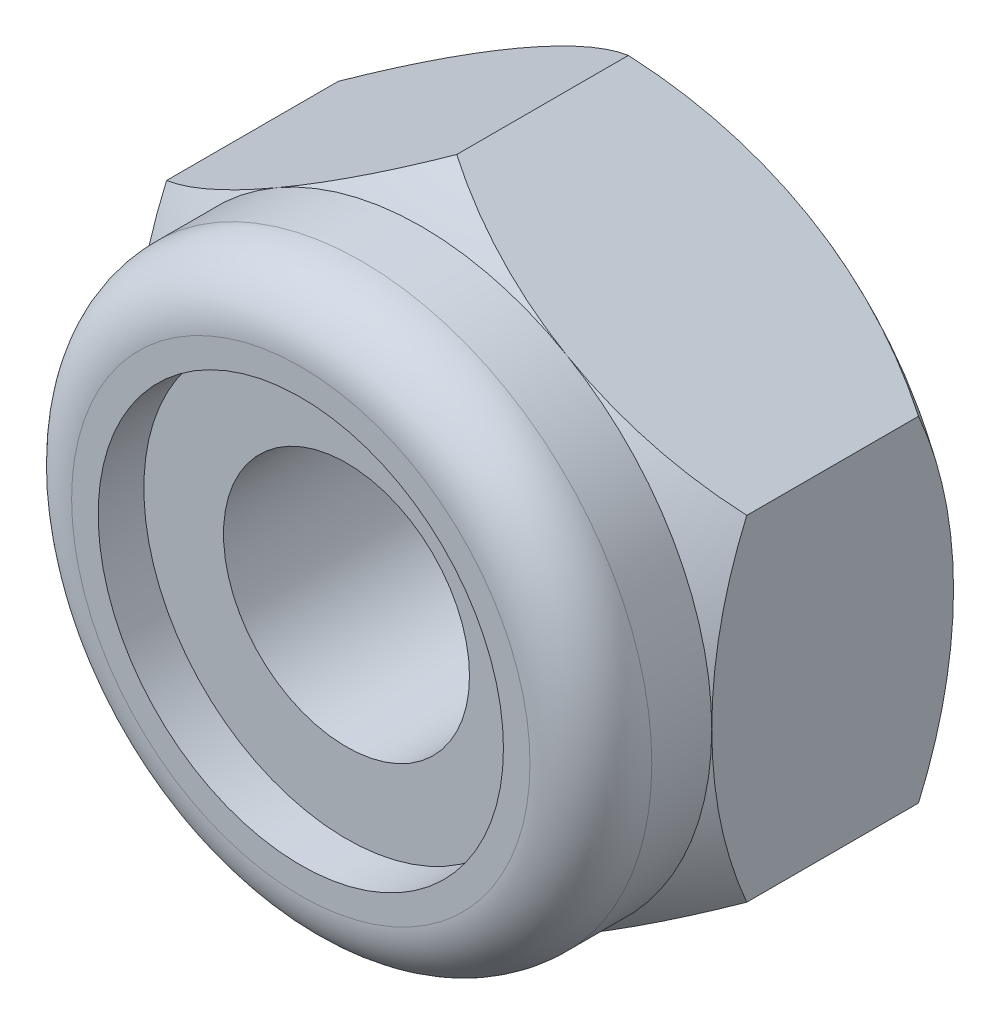
ISO-10303-21;
HEADER;
FILE_DESCRIPTION(('STEP AP214'),'2;1');
FILE_NAME('part.step','',(''),(''),'','','');
FILE_SCHEMA(('AUTOMOTIVE_DESIGN { 1 0 10303 214 1 1 1 1 }'));
ENDSEC;
DATA;
#1=APPLICATION_CONTEXT('core data for automotive mechanical design processes');
#2=APPLICATION_PROTOCOL_DEFINITION('international standard','automotive_design',2000,#1);
#3=PRODUCT_CONTEXT('',#1,'mechanical');
#4=PRODUCT('Part','Part','',(#3));
#5=PRODUCT_RELATED_PRODUCT_CATEGORY('part','',(#4));
#6=PRODUCT_DEFINITION_FORMATION('','',#4);
#7=PRODUCT_DEFINITION_CONTEXT('part definition',#1,'design');
#8=PRODUCT_DEFINITION('design','',#6,#7);
#9=PRODUCT_DEFINITION_SHAPE('','',#8);
#10=(LENGTH_UNIT() NAMED_UNIT(*) SI_UNIT(.MILLI.,.METRE.));
#11=(NAMED_UNIT(*) PLANE_ANGLE_UNIT() SI_UNIT($,.RADIAN.));
#12=(NAMED_UNIT(*) SI_UNIT($,.STERADIAN.) SOLID_ANGLE_UNIT());
#13=UNCERTAINTY_MEASURE_WITH_UNIT(LENGTH_MEASURE(1.E-05),#10,'distance_accuracy_value','');
#14=(GEOMETRIC_REPRESENTATION_CONTEXT(3) GLOBAL_UNCERTAINTY_ASSIGNED_CONTEXT((#13)) GLOBAL_UNIT_ASSIGNED_CONTEXT((#10,
#11,#12)) REPRESENTATION_CONTEXT('',''));
#15=CARTESIAN_POINT('',(0.,0.,0.));
#16=DIRECTION('',(0.,0.,1.));
#17=DIRECTION('',(1.,0.,0.));
#18=AXIS2_PLACEMENT_3D('',#15,#16,#17);
#19=CARTESIAN_POINT('',(0.,0.,4.953125));
#20=DIRECTION('',(0.,0.,1.));
#21=DIRECTION('',(1.,0.,0.));
#22=AXIS2_PLACEMENT_3D('',#19,#20,#21);
#23=TOROIDAL_SURFACE('',#22,3.7625,1.);
#24=CARTESIAN_POINT('',(0.,0.,4.953125));
#25=DIRECTION('',(0.,0.,-1.));
#26=DIRECTION('',(-1.,0.,0.));
#27=AXIS2_PLACEMENT_3D('',#24,#25,#26);
#28=CIRCLE('',#27,4.7625);
#29=CARTESIAN_POINT('',(-4.7625,0.,4.953125));
#30=VERTEX_POINT('',#29);
#31=EDGE_CURVE('E123',#30,#30,#28,.T.);
#32=ORIENTED_EDGE('',*,*,#31,.F.);
#33=EDGE_LOOP('',(#32));
#34=FACE_BOUND('',#33,.T.);
#35=CARTESIAN_POINT('',(0.,0.,5.953125));
#36=DIRECTION('',(0.,0.,-1.));
#37=DIRECTION('',(1.,0.,0.));
#38=AXIS2_PLACEMENT_3D('',#35,#36,#37);
#39=CIRCLE('',#38,3.7625);
#40=CARTESIAN_POINT('',(-3.7625,0.,5.953125));
#41=VERTEX_POINT('',#40);
#42=CARTESIAN_POINT('',(3.7625,0.,5.953125));
#43=VERTEX_POINT('',#42);
#44=EDGE_CURVE('E113',#41,#43,#39,.F.);
#45=ORIENTED_EDGE('',*,*,#44,.F.);
#46=CARTESIAN_POINT('',(0.,0.,5.953125));
#47=DIRECTION('',(0.,0.,-1.));
#48=DIRECTION('',(-1.,0.,0.));
#49=AXIS2_PLACEMENT_3D('',#46,#47,#48);
#50=CIRCLE('',#49,3.7625);
#51=EDGE_CURVE('E117',#43,#41,#50,.F.);
#52=ORIENTED_EDGE('',*,*,#51,.F.);
#53=EDGE_LOOP('',(#45,#52));
#54=FACE_BOUND('',#53,.T.);
#55=ADVANCED_FACE('F15',(#34,#54),#23,.T.);
#56=CARTESIAN_POINT('',(0.,0.,5.953125));
#57=DIRECTION('',(0.,0.,1.));
#58=DIRECTION('',(1.,0.,0.));
#59=AXIS2_PLACEMENT_3D('',#56,#57,#58);
#60=PLANE('',#59);
#61=CARTESIAN_POINT('',(0.,0.,5.953125));
#62=DIRECTION('',(0.,0.,1.));
#63=DIRECTION('',(1.,0.,0.));
#64=AXIS2_PLACEMENT_3D('',#61,#62,#63);
#65=CIRCLE('',#64,3.32676299779793);
#66=CARTESIAN_POINT('',(3.32676299779793,0.,5.953125));
#67=VERTEX_POINT('',#66);
#68=EDGE_CURVE('E269',#67,#67,#65,.F.);
#69=ORIENTED_EDGE('',*,*,#68,.T.);
#70=EDGE_LOOP('',(#69));
#71=FACE_BOUND('',#70,.T.);
#72=ORIENTED_EDGE('',*,*,#51,.T.);
#73=ORIENTED_EDGE('',*,*,#44,.T.);
#74=EDGE_LOOP('',(#72,#73));
#75=FACE_BOUND('',#74,.T.);
#76=ADVANCED_FACE('F122',(#71,#75),#60,.T.);
#77=CARTESIAN_POINT('',(0.,0.,5.953125));
#78=DIRECTION('',(0.,0.,-1.));
#79=DIRECTION('',(-1.,0.,0.));
#80=AXIS2_PLACEMENT_3D('',#77,#78,#79);
#81=CYLINDRICAL_SURFACE('',#80,4.7625);
#82=ORIENTED_EDGE('',*,*,#31,.T.);
#83=EDGE_LOOP('',(#82));
#84=FACE_BOUND('',#83,.T.);
#85=CARTESIAN_POINT('',(0.,0.,3.96875000000001));
#86=DIRECTION('',(0.,0.,-1.));
#87=DIRECTION('',(-1.,0.,0.));
#88=AXIS2_PLACEMENT_3D('',#85,#86,#87);
#89=CIRCLE('',#88,4.7625);
#90=CARTESIAN_POINT('',(2.38124999999999,-4.1244459855234,3.96875000000001));
#91=VERTEX_POINT('',#90);
#92=CARTESIAN_POINT('',(-2.38124999999999,-4.1244459855234,3.96875000000002));
#93=VERTEX_POINT('',#92);
#94=EDGE_CURVE('E106',#91,#93,#89,.T.);
#95=ORIENTED_EDGE('',*,*,#94,.F.);
#96=CARTESIAN_POINT('',(0.,0.,3.96875000000001));
#97=DIRECTION('',(0.,0.,-1.));
#98=DIRECTION('',(-1.,0.,0.));
#99=AXIS2_PLACEMENT_3D('',#96,#97,#98);
#100=CIRCLE('',#99,4.7625);
#101=CARTESIAN_POINT('',(4.76249999999073,0.,3.96875000000644));
#102=VERTEX_POINT('',#101);
#103=EDGE_CURVE('E255',#102,#91,#100,.T.);
#104=ORIENTED_EDGE('',*,*,#103,.F.);
#105=CARTESIAN_POINT('',(0.,0.,3.96875000000001));
#106=DIRECTION('',(0.,0.,-1.));
#107=DIRECTION('',(-1.,0.,0.));
#108=AXIS2_PLACEMENT_3D('',#105,#106,#107);
#109=CIRCLE('',#108,4.7625);
#110=CARTESIAN_POINT('',(2.38125,4.12444598552339,3.96875000000001));
#111=VERTEX_POINT('',#110);
#112=EDGE_CURVE('E257',#111,#102,#109,.T.);
#113=ORIENTED_EDGE('',*,*,#112,.F.);
#114=CARTESIAN_POINT('',(0.,0.,3.96875000000001));
#115=DIRECTION('',(0.,0.,-1.));
#116=DIRECTION('',(-1.,0.,0.));
#117=AXIS2_PLACEMENT_3D('',#114,#115,#116);
#118=CIRCLE('',#117,4.7625);
#119=CARTESIAN_POINT('',(-2.38125,4.12444598552339,3.96875000000001));
#120=VERTEX_POINT('',#119);
#121=EDGE_CURVE('E260',#120,#111,#118,.T.);
#122=ORIENTED_EDGE('',*,*,#121,.F.);
#123=CARTESIAN_POINT('',(0.,0.,3.96875000000001));
#124=DIRECTION('',(0.,0.,-1.));
#125=DIRECTION('',(-1.,0.,0.));
#126=AXIS2_PLACEMENT_3D('',#123,#124,#125);
#127=CIRCLE('',#126,4.7625);
#128=CARTESIAN_POINT('',(-4.76249999999074,0.,3.96875000000645));
#129=VERTEX_POINT('',#128);
#130=EDGE_CURVE('E263',#129,#120,#127,.T.);
#131=ORIENTED_EDGE('',*,*,#130,.F.);
#132=CARTESIAN_POINT('',(0.,0.,3.96875000000001));
#133=DIRECTION('',(0.,0.,-1.));
#134=DIRECTION('',(-1.,0.,0.));
#135=AXIS2_PLACEMENT_3D('',#132,#133,#134);
#136=CIRCLE('',#135,4.7625);
#137=EDGE_CURVE('E266',#93,#129,#136,.T.);
#138=ORIENTED_EDGE('',*,*,#137,.F.);
#139=EDGE_LOOP('',(#95,#104,#113,#122,#131,#138));
#140=FACE_BOUND('',#139,.T.);
#141=ADVANCED_FACE('F141',(#84,#140),#81,.T.);
#142=CARTESIAN_POINT('',(0.,0.,5.953125));
#143=DIRECTION('',(0.,0.,1.));
#144=DIRECTION('',(1.,0.,0.));
#145=AXIS2_PLACEMENT_3D('',#142,#143,#144);
#146=CYLINDRICAL_SURFACE('',#145,3.32676299779793);
#147=CARTESIAN_POINT('',(0.,0.,5.203125));
#148=DIRECTION('',(0.,0.,1.));
#149=DIRECTION('',(1.,0.,0.));
#150=AXIS2_PLACEMENT_3D('',#147,#148,#149);
#151=CIRCLE('',#150,3.32676299779793);
#152=CARTESIAN_POINT('',(3.32676299779793,0.,5.203125));
#153=VERTEX_POINT('',#152);
#154=EDGE_CURVE('E252',#153,#153,#151,.F.);
#155=ORIENTED_EDGE('',*,*,#154,.T.);
#156=EDGE_LOOP('',(#155));
#157=FACE_BOUND('',#156,.T.);
#158=ORIENTED_EDGE('',*,*,#68,.F.);
#159=EDGE_LOOP('',(#158));
#160=FACE_BOUND('',#159,.T.);
#161=ADVANCED_FACE('F276',(#157,#160),#146,.F.);
#162=CARTESIAN_POINT('',(0.,0.,-2.89662617308758));
#163=DIRECTION('',(1.,0.,0.));
#164=DIRECTION('',(0.,-0.514062280042823,0.857752861981337));
#165=AXIS2_PLACEMENT_3D('',#162,#163,#164);
#166=SPHERICAL_SURFACE('',#165,8.3555248936257);
#167=CARTESIAN_POINT('',(2.38125,-4.1244459855234,-2.89662617308758));
#168=DIRECTION('',(0.5,-0.866025403784439,0.));
#169=DIRECTION('',(0.866025403784439,0.5,0.));
#170=AXIS2_PLACEMENT_3D('',#167,#168,#169);
#171=CIRCLE('',#170,6.86537617308759);
#172=CARTESIAN_POINT('',(3.73982528972805E-11,-5.49926131405278,3.39407499989476));
#173=VERTEX_POINT('',#172);
#174=EDGE_CURVE('E247',#91,#173,#171,.T.);
#175=ORIENTED_EDGE('',*,*,#174,.F.);
#176=ORIENTED_EDGE('',*,*,#94,.T.);
#177=CARTESIAN_POINT('',(-2.38125,-4.1244459855234,-2.89662617308758));
#178=DIRECTION('',(-0.5,-0.866025403784439,0.));
#179=DIRECTION('',(0.866025403784439,-0.5,0.));
#180=AXIS2_PLACEMENT_3D('',#177,#178,#179);
#181=CIRCLE('',#180,6.86537617308759);
#182=EDGE_CURVE('E243',#173,#93,#181,.T.);
#183=ORIENTED_EDGE('',*,*,#182,.F.);
#184=EDGE_LOOP('',(#175,#176,#183));
#185=FACE_BOUND('',#184,.T.);
#186=ADVANCED_FACE('F149',(#185),#166,.T.);
#187=CARTESIAN_POINT('',(0.,0.,-2.89662617308762));
#188=DIRECTION('',(1.,0.,0.));
#189=DIRECTION('',(0.,0.00324586478599376,0.999994732167021));
#190=AXIS2_PLACEMENT_3D('',#187,#188,#189);
#191=SPHERICAL_SURFACE('',#190,8.35552489362575);
#192=CARTESIAN_POINT('',(-2.38124999999997,-4.12444598552341,-2.89662617308762));
#193=DIRECTION('',(-0.5,-0.866025403784439,0.));
#194=DIRECTION('',(0.866025403784439,-0.5,0.));
#195=AXIS2_PLACEMENT_3D('',#192,#193,#194);
#196=CIRCLE('',#195,6.86537617308764);
#197=CARTESIAN_POINT('',(-4.7625,-2.74963065700324,3.39407499991903));
#198=VERTEX_POINT('',#197);
#199=EDGE_CURVE('E241',#93,#198,#196,.T.);
#200=ORIENTED_EDGE('',*,*,#199,.F.);
#201=ORIENTED_EDGE('',*,*,#137,.T.);
#202=CARTESIAN_POINT('',(-4.7625,0.,-2.89662617308762));
#203=DIRECTION('',(1.,0.,0.));
#204=DIRECTION('',(0.,0.,-1.));
#205=AXIS2_PLACEMENT_3D('',#202,#203,#204);
#206=CIRCLE('',#205,6.86537617308763);
#207=EDGE_CURVE('E237',#198,#129,#206,.F.);
#208=ORIENTED_EDGE('',*,*,#207,.F.);
#209=EDGE_LOOP('',(#200,#201,#208));
#210=FACE_BOUND('',#209,.T.);
#211=ADVANCED_FACE('F389',(#210),#191,.T.);
#212=CARTESIAN_POINT('',(0.,0.,-2.89662617308757));
#213=DIRECTION('',(1.,0.,0.));
#214=DIRECTION('',(0.,0.517754599312686,0.855529178281232));
#215=AXIS2_PLACEMENT_3D('',#212,#213,#214);
#216=SPHERICAL_SURFACE('',#215,8.35552489362573);
#217=CARTESIAN_POINT('',(-4.76249999998147,0.,-2.89662617308757));
#218=DIRECTION('',(1.,0.,0.));
#219=DIRECTION('',(0.,0.,-1.));
#220=AXIS2_PLACEMENT_3D('',#217,#218,#219);
#221=CIRCLE('',#220,6.86537617310046);
#222=CARTESIAN_POINT('',(-4.76249999994795,2.74963065704565,3.39407499993991));
#223=VERTEX_POINT('',#222);
#224=EDGE_CURVE('E235',#129,#223,#221,.F.);
#225=ORIENTED_EDGE('',*,*,#224,.F.);
#226=ORIENTED_EDGE('',*,*,#130,.T.);
#227=CARTESIAN_POINT('',(-2.38125000000001,4.12444598552338,-2.89662617308757));
#228=DIRECTION('',(-0.5,0.866025403784439,0.));
#229=DIRECTION('',(-0.866025403784439,-0.5,0.));
#230=AXIS2_PLACEMENT_3D('',#227,#228,#229);
#231=CIRCLE('',#230,6.86537617308758);
#232=EDGE_CURVE('E231',#223,#120,#231,.T.);
#233=ORIENTED_EDGE('',*,*,#232,.F.);
#234=EDGE_LOOP('',(#225,#226,#233));
#235=FACE_BOUND('',#234,.T.);
#236=ADVANCED_FACE('F401',(#235),#216,.T.);
#237=CARTESIAN_POINT('',(0.,0.,-2.89662617308755));
#238=DIRECTION('',(1.,0.,0.));
#239=DIRECTION('',(0.,0.658959645209422,0.752178294013775));
#240=AXIS2_PLACEMENT_3D('',#237,#238,#239);
#241=SPHERICAL_SURFACE('',#240,8.35552489362568);
#242=ORIENTED_EDGE('',*,*,#121,.T.);
#243=CARTESIAN_POINT('',(2.38125,4.12444598552339,-2.89662617308755));
#244=DIRECTION('',(0.5,0.866025403784439,0.));
#245=DIRECTION('',(-0.866025403784439,0.5,0.));
#246=AXIS2_PLACEMENT_3D('',#243,#244,#245);
#247=CIRCLE('',#246,6.86537617308756);
#248=CARTESIAN_POINT('',(4.83337328494038E-11,5.49926131400328,3.39407499993803));
#249=VERTEX_POINT('',#248);
#250=EDGE_CURVE('E225',#249,#111,#247,.T.);
#251=ORIENTED_EDGE('',*,*,#250,.F.);
#252=CARTESIAN_POINT('',(-2.38125,4.12444598552339,-2.89662617308755));
#253=DIRECTION('',(-0.5,0.866025403784439,0.));
#254=DIRECTION('',(-0.866025403784439,-0.5,0.));
#255=AXIS2_PLACEMENT_3D('',#252,#253,#254);
#256=CIRCLE('',#255,6.86537617308756);
#257=EDGE_CURVE('E229',#120,#249,#256,.T.);
#258=ORIENTED_EDGE('',*,*,#257,.F.);
#259=EDGE_LOOP('',(#242,#251,#258));
#260=FACE_BOUND('',#259,.T.);
#261=ADVANCED_FACE('F339',(#260),#241,.T.);
#262=CARTESIAN_POINT('',(0.,0.,-2.89662617308756));
#263=DIRECTION('',(1.,0.,0.));
#264=DIRECTION('',(0.,0.517754599312686,0.855529178281232));
#265=AXIS2_PLACEMENT_3D('',#262,#263,#264);
#266=SPHERICAL_SURFACE('',#265,8.35552489362571);
#267=ORIENTED_EDGE('',*,*,#112,.T.);
#268=CARTESIAN_POINT('',(4.76250000000002,0.,-2.89662617308756));
#269=DIRECTION('',(1.,0.,0.));
#270=DIRECTION('',(0.,0.,-1.));
#271=AXIS2_PLACEMENT_3D('',#268,#269,#270);
#272=CIRCLE('',#271,6.86537617308759);
#273=CARTESIAN_POINT('',(4.76250000000002,2.74963065695978,3.39407499993802));
#274=VERTEX_POINT('',#273);
#275=EDGE_CURVE('E219',#274,#102,#272,.T.);
#276=ORIENTED_EDGE('',*,*,#275,.F.);
#277=CARTESIAN_POINT('',(2.38125000000001,4.12444598552338,-2.89662617308756));
#278=DIRECTION('',(0.5,0.866025403784439,0.));
#279=DIRECTION('',(-0.866025403784439,0.5,0.));
#280=AXIS2_PLACEMENT_3D('',#277,#278,#279);
#281=CIRCLE('',#280,6.86537617308757);
#282=EDGE_CURVE('E223',#111,#274,#281,.T.);
#283=ORIENTED_EDGE('',*,*,#282,.F.);
#284=EDGE_LOOP('',(#267,#276,#283));
#285=FACE_BOUND('',#284,.T.);
#286=ADVANCED_FACE('F328',(#285),#266,.T.);
#287=CARTESIAN_POINT('',(0.,0.,-2.8966261730876));
#288=DIRECTION('',(1.,0.,0.));
#289=DIRECTION('',(0.,0.00324586478599376,0.999994732167021));
#290=AXIS2_PLACEMENT_3D('',#287,#288,#289);
#291=SPHERICAL_SURFACE('',#290,8.35552489362573);
#292=ORIENTED_EDGE('',*,*,#103,.T.);
#293=CARTESIAN_POINT('',(2.38124999999998,-4.1244459855234,-2.8966261730876));
#294=DIRECTION('',(0.5,-0.866025403784439,0.));
#295=DIRECTION('',(0.866025403784439,0.5,0.));
#296=AXIS2_PLACEMENT_3D('',#293,#294,#295);
#297=CIRCLE('',#296,6.86537617308761);
#298=CARTESIAN_POINT('',(4.76249999998147,-2.74963065704565,3.39407499991452));
#299=VERTEX_POINT('',#298);
#300=EDGE_CURVE('E249',#299,#91,#297,.T.);
#301=ORIENTED_EDGE('',*,*,#300,.F.);
#302=CARTESIAN_POINT('',(4.76249999998147,0.,-2.8966261730876));
#303=DIRECTION('',(1.,0.,0.));
#304=DIRECTION('',(0.,0.,-1.));
#305=AXIS2_PLACEMENT_3D('',#302,#303,#304);
#306=CIRCLE('',#305,6.86537617310046);
#307=EDGE_CURVE('E216',#102,#299,#306,.T.);
#308=ORIENTED_EDGE('',*,*,#307,.F.);
#309=EDGE_LOOP('',(#292,#301,#308));
#310=FACE_BOUND('',#309,.T.);
#311=ADVANCED_FACE('F323',(#310),#291,.T.);
#312=CARTESIAN_POINT('',(2.01930000000001,0.,5.203125));
#313=DIRECTION('',(0.,0.,-1.));
#314=DIRECTION('',(-1.,0.,0.));
#315=AXIS2_PLACEMENT_3D('',#312,#313,#314);
#316=PLANE('',#315);
#317=ORIENTED_EDGE('',*,*,#154,.F.);
#318=EDGE_LOOP('',(#317));
#319=FACE_BOUND('',#318,.T.);
#320=CARTESIAN_POINT('',(0.,0.,5.203125));
#321=DIRECTION('',(0.,0.,1.));
#322=DIRECTION('',(1.,0.,0.));
#323=AXIS2_PLACEMENT_3D('',#320,#321,#322);
#324=CIRCLE('',#323,2.01930000000001);
#325=CARTESIAN_POINT('',(2.01930000000001,0.,5.203125));
#326=VERTEX_POINT('',#325);
#327=EDGE_CURVE('E212',#326,#326,#324,.F.);
#328=ORIENTED_EDGE('',*,*,#327,.T.);
#329=EDGE_LOOP('',(#328));
#330=FACE_BOUND('',#329,.T.);
#331=ADVANCED_FACE('F320',(#319,#330),#316,.F.);
#332=CARTESIAN_POINT('',(2.38125,-4.12444598552339,1.984375));
#333=DIRECTION('',(0.5,-0.866025403784439,0.));
#334=DIRECTION('',(0.866025403784439,0.5,0.));
#335=AXIS2_PLACEMENT_3D('',#332,#333,#334);
#336=PLANE('',#335);
#337=CARTESIAN_POINT('',(2.38125,-4.12444598552339,6.86537617308756));
#338=DIRECTION('',(0.5,-0.866025403784439,0.));
#339=DIRECTION('',(0.866025403784439,0.5,0.));
#340=AXIS2_PLACEMENT_3D('',#337,#338,#339);
#341=CIRCLE('',#340,6.86537617308756);
#342=CARTESIAN_POINT('',(2.38125,-4.12444598552339,0.));
#343=VERTEX_POINT('',#342);
#344=CARTESIAN_POINT('',(3.73983613174977E-11,-5.49926131405278,0.574675000105255));
#345=VERTEX_POINT('',#344);
#346=EDGE_CURVE('E203',#343,#345,#341,.F.);
#347=ORIENTED_EDGE('',*,*,#346,.F.);
#348=CARTESIAN_POINT('',(2.38124999999999,-4.1244459855234,6.86537617308758));
#349=DIRECTION('',(0.5,-0.866025403784439,0.));
#350=DIRECTION('',(0.866025403784439,0.5,0.));
#351=AXIS2_PLACEMENT_3D('',#348,#349,#350);
#352=CIRCLE('',#351,6.86537617308757);
#353=CARTESIAN_POINT('',(4.7625,-2.7496306570403,0.574675000097181));
#354=VERTEX_POINT('',#353);
#355=EDGE_CURVE('E206',#354,#343,#352,.F.);
#356=ORIENTED_EDGE('',*,*,#355,.F.);
#357=DIRECTION('',(0.,0.,-1.));
#358=VECTOR('',#357,1.);
#359=CARTESIAN_POINT('',(4.7625,-2.749630657065,1.984375));
#360=LINE('',#359,#358);
#361=EDGE_CURVE('E215',#299,#354,#360,.T.);
#362=ORIENTED_EDGE('',*,*,#361,.F.);
#363=ORIENTED_EDGE('',*,*,#300,.T.);
#364=ORIENTED_EDGE('',*,*,#174,.T.);
#365=DIRECTION('',(0.,0.,1.));
#366=VECTOR('',#365,1.);
#367=CARTESIAN_POINT('',(7.4795638432823E-11,-5.49926131407437,1.984375));
#368=LINE('',#367,#366);
#369=EDGE_CURVE('E246',#345,#173,#368,.T.);
#370=ORIENTED_EDGE('',*,*,#369,.F.);
#371=EDGE_LOOP('',(#347,#356,#362,#363,#364,#370));
#372=FACE_BOUND('',#371,.T.);
#373=ADVANCED_FACE('F316',(#372),#336,.T.);
#374=CARTESIAN_POINT('',(-2.38125,-4.12444598552339,1.984375));
#375=DIRECTION('',(-0.5,-0.866025403784439,0.));
#376=DIRECTION('',(0.866025403784439,-0.5,0.));
#377=AXIS2_PLACEMENT_3D('',#374,#375,#376);
#378=PLANE('',#377);
#379=CARTESIAN_POINT('',(-2.38124999999997,-4.12444598552341,6.86537617308761));
#380=DIRECTION('',(-0.5,-0.866025403784439,0.));
#381=DIRECTION('',(0.866025403784439,-0.5,0.));
#382=AXIS2_PLACEMENT_3D('',#379,#380,#381);
#383=CIRCLE('',#382,6.86537617308761);
#384=CARTESIAN_POINT('',(-2.38124999999999,-4.1244459855234,0.));
#385=VERTEX_POINT('',#384);
#386=CARTESIAN_POINT('',(-4.7624999999984,-2.74963065700015,0.574675000078425));
#387=VERTEX_POINT('',#386);
#388=EDGE_CURVE('E194',#385,#387,#383,.F.);
#389=ORIENTED_EDGE('',*,*,#388,.F.);
#390=CARTESIAN_POINT('',(-2.38125,-4.12444598552339,6.86537617308756));
#391=DIRECTION('',(-0.5,-0.866025403784439,0.));
#392=DIRECTION('',(0.866025403784439,-0.5,0.));
#393=AXIS2_PLACEMENT_3D('',#390,#391,#392);
#394=CIRCLE('',#393,6.86537617308756);
#395=EDGE_CURVE('E200',#345,#385,#394,.F.);
#396=ORIENTED_EDGE('',*,*,#395,.F.);
#397=ORIENTED_EDGE('',*,*,#369,.T.);
#398=ORIENTED_EDGE('',*,*,#182,.T.);
#399=ORIENTED_EDGE('',*,*,#199,.T.);
#400=DIRECTION('',(0.,0.,1.));
#401=VECTOR('',#400,1.);
#402=CARTESIAN_POINT('',(-4.7625,-2.74963065699089,1.984375));
#403=LINE('',#402,#401);
#404=EDGE_CURVE('E240',#387,#198,#403,.T.);
#405=ORIENTED_EDGE('',*,*,#404,.F.);
#406=EDGE_LOOP('',(#389,#396,#397,#398,#399,#405));
#407=FACE_BOUND('',#406,.T.);
#408=ADVANCED_FACE('F312',(#407),#378,.T.);
#409=CARTESIAN_POINT('',(-4.7625,0.,1.984375));
#410=DIRECTION('',(-1.,0.,0.));
#411=DIRECTION('',(0.,0.,1.));
#412=AXIS2_PLACEMENT_3D('',#409,#410,#411);
#413=PLANE('',#412);
#414=CARTESIAN_POINT('',(-4.76249999999999,0.,6.86537617308759));
#415=DIRECTION('',(1.,0.,0.));
#416=DIRECTION('',(0.,0.,-1.));
#417=AXIS2_PLACEMENT_3D('',#414,#415,#416);
#418=CIRCLE('',#417,6.86537617308759);
#419=CARTESIAN_POINT('',(-4.76249999999652,0.,-2.40649514204883E-12));
#420=VERTEX_POINT('',#419);
#421=CARTESIAN_POINT('',(-4.76249999995722,2.7496306570403,0.574675000064785));
#422=VERTEX_POINT('',#421);
#423=EDGE_CURVE('E191',#420,#422,#418,.T.);
#424=ORIENTED_EDGE('',*,*,#423,.F.);
#425=CARTESIAN_POINT('',(-4.7624999999861,0.,6.8653761730876));
#426=DIRECTION('',(1.,0.,0.));
#427=DIRECTION('',(0.,0.,-1.));
#428=AXIS2_PLACEMENT_3D('',#425,#426,#427);
#429=CIRCLE('',#428,6.86537617309723);
#430=EDGE_CURVE('E197',#387,#420,#429,.T.);
#431=ORIENTED_EDGE('',*,*,#430,.F.);
#432=ORIENTED_EDGE('',*,*,#404,.T.);
#433=ORIENTED_EDGE('',*,*,#207,.T.);
#434=ORIENTED_EDGE('',*,*,#224,.T.);
#435=DIRECTION('',(0.,0.,1.));
#436=VECTOR('',#435,1.);
#437=CARTESIAN_POINT('',(-4.76249999991443,2.749630657065,1.984375));
#438=LINE('',#437,#436);
#439=EDGE_CURVE('E234',#422,#223,#438,.T.);
#440=ORIENTED_EDGE('',*,*,#439,.F.);
#441=EDGE_LOOP('',(#424,#431,#432,#433,#434,#440));
#442=FACE_BOUND('',#441,.T.);
#443=ADVANCED_FACE('F308',(#442),#413,.T.);
#444=CARTESIAN_POINT('',(-2.38125,4.12444598552339,1.984375));
#445=DIRECTION('',(-0.5,0.866025403784439,0.));
#446=DIRECTION('',(-0.866025403784439,-0.5,0.));
#447=AXIS2_PLACEMENT_3D('',#444,#445,#446);
#448=PLANE('',#447);
#449=CARTESIAN_POINT('',(-2.38125,4.12444598552339,6.86537617308756));
#450=DIRECTION('',(-0.5,0.866025403784439,0.));
#451=DIRECTION('',(-0.866025403784439,-0.5,0.));
#452=AXIS2_PLACEMENT_3D('',#449,#450,#451);
#453=CIRCLE('',#452,6.86537617308756);
#454=CARTESIAN_POINT('',(-2.38125,4.12444598552339,0.));
#455=VERTEX_POINT('',#454);
#456=CARTESIAN_POINT('',(4.83337328494038E-11,5.49926131400328,0.574675000061984));
#457=VERTEX_POINT('',#456);
#458=EDGE_CURVE('E185',#455,#457,#453,.F.);
#459=ORIENTED_EDGE('',*,*,#458,.F.);
#460=CARTESIAN_POINT('',(-2.38124999999999,4.1244459855234,6.86537617308758));
#461=DIRECTION('',(-0.5,0.866025403784439,0.));
#462=DIRECTION('',(-0.866025403784439,-0.5,0.));
#463=AXIS2_PLACEMENT_3D('',#460,#461,#462);
#464=CIRCLE('',#463,6.86537617308759);
#465=EDGE_CURVE('E188',#422,#455,#464,.F.);
#466=ORIENTED_EDGE('',*,*,#465,.F.);
#467=ORIENTED_EDGE('',*,*,#439,.T.);
#468=ORIENTED_EDGE('',*,*,#232,.T.);
#469=ORIENTED_EDGE('',*,*,#257,.T.);
#470=DIRECTION('',(0.,0.,1.));
#471=VECTOR('',#470,1.);
#472=CARTESIAN_POINT('',(9.66687667414146E-11,5.49926131397537,1.984375));
#473=LINE('',#472,#471);
#474=EDGE_CURVE('E228',#457,#249,#473,.T.);
#475=ORIENTED_EDGE('',*,*,#474,.F.);
#476=EDGE_LOOP('',(#459,#466,#467,#468,#469,#475));
#477=FACE_BOUND('',#476,.T.);
#478=ADVANCED_FACE('F305',(#477),#448,.T.);
#479=CARTESIAN_POINT('',(2.38125,4.12444598552339,1.984375));
#480=DIRECTION('',(0.5,0.866025403784439,0.));
#481=DIRECTION('',(-0.866025403784439,0.5,0.));
#482=AXIS2_PLACEMENT_3D('',#479,#480,#481);
#483=PLANE('',#482);
#484=CARTESIAN_POINT('',(2.38125000000001,4.12444598552339,6.86537617308754));
#485=DIRECTION('',(0.5,0.866025403784439,0.));
#486=DIRECTION('',(-0.866025403784439,0.5,0.));
#487=AXIS2_PLACEMENT_3D('',#484,#485,#486);
#488=CIRCLE('',#487,6.86537617308754);
#489=CARTESIAN_POINT('',(2.38125,4.12444598552339,0.));
#490=VERTEX_POINT('',#489);
#491=CARTESIAN_POINT('',(4.76250000000719,2.7496306569577,0.574675000066537));
#492=VERTEX_POINT('',#491);
#493=EDGE_CURVE('E36',#490,#492,#488,.F.);
#494=ORIENTED_EDGE('',*,*,#493,.F.);
#495=CARTESIAN_POINT('',(2.38125,4.12444598552339,6.86537617308756));
#496=DIRECTION('',(0.5,0.866025403784439,0.));
#497=DIRECTION('',(-0.866025403784439,0.5,0.));
#498=AXIS2_PLACEMENT_3D('',#495,#496,#497);
#499=CIRCLE('',#498,6.86537617308756);
#500=EDGE_CURVE('E183',#457,#490,#499,.F.);
#501=ORIENTED_EDGE('',*,*,#500,.F.);
#502=ORIENTED_EDGE('',*,*,#474,.T.);
#503=ORIENTED_EDGE('',*,*,#250,.T.);
#504=ORIENTED_EDGE('',*,*,#282,.T.);
#505=DIRECTION('',(0.,0.,-1.));
#506=VECTOR('',#505,1.);
#507=CARTESIAN_POINT('',(4.7625,2.74963065690397,1.984375));
#508=LINE('',#507,#506);
#509=EDGE_CURVE('E222',#492,#274,#508,.F.);
#510=ORIENTED_EDGE('',*,*,#509,.F.);
#511=EDGE_LOOP('',(#494,#501,#502,#503,#504,#510));
#512=FACE_BOUND('',#511,.T.);
#513=ADVANCED_FACE('F301',(#512),#483,.T.);
#514=CARTESIAN_POINT('',(4.7625,0.,1.984375));
#515=DIRECTION('',(1.,0.,0.));
#516=DIRECTION('',(0.,0.,-1.));
#517=AXIS2_PLACEMENT_3D('',#514,#515,#516);
#518=PLANE('',#517);
#519=CARTESIAN_POINT('',(4.7625,0.,6.86537617308758));
#520=DIRECTION('',(1.,0.,0.));
#521=DIRECTION('',(0.,0.,-1.));
#522=AXIS2_PLACEMENT_3D('',#519,#520,#521);
#523=CIRCLE('',#522,6.86537617308757);
#524=CARTESIAN_POINT('',(4.7625000000018,0.,1.25008510487579E-12));
#525=VERTEX_POINT('',#524);
#526=EDGE_CURVE('E209',#525,#354,#523,.F.);
#527=ORIENTED_EDGE('',*,*,#526,.F.);
#528=CARTESIAN_POINT('',(4.76250000000716,0.,6.86537617308758));
#529=DIRECTION('',(1.,0.,0.));
#530=DIRECTION('',(0.,0.,-1.));
#531=AXIS2_PLACEMENT_3D('',#528,#529,#530);
#532=CIRCLE('',#531,6.86537617308258);
#533=EDGE_CURVE('E179',#492,#525,#532,.F.);
#534=ORIENTED_EDGE('',*,*,#533,.F.);
#535=ORIENTED_EDGE('',*,*,#509,.T.);
#536=ORIENTED_EDGE('',*,*,#275,.T.);
#537=ORIENTED_EDGE('',*,*,#307,.T.);
#538=ORIENTED_EDGE('',*,*,#361,.T.);
#539=EDGE_LOOP('',(#527,#534,#535,#536,#537,#538));
#540=FACE_BOUND('',#539,.T.);
#541=ADVANCED_FACE('F297',(#540),#518,.T.);
#542=CARTESIAN_POINT('',(0.,0.,5.953125));
#543=DIRECTION('',(0.,0.,1.));
#544=DIRECTION('',(1.,0.,0.));
#545=AXIS2_PLACEMENT_3D('',#542,#543,#544);
#546=CYLINDRICAL_SURFACE('',#545,2.01930000000001);
#547=CARTESIAN_POINT('',(0.,0.,0.));
#548=DIRECTION('',(0.,0.,1.));
#549=DIRECTION('',(1.,0.,0.));
#550=AXIS2_PLACEMENT_3D('',#547,#548,#549);
#551=CIRCLE('',#550,2.01930000000001);
#552=CARTESIAN_POINT('',(2.01930000000001,0.,0.));
#553=VERTEX_POINT('',#552);
#554=EDGE_CURVE('E176',#553,#553,#551,.T.);
#555=ORIENTED_EDGE('',*,*,#554,.F.);
#556=EDGE_LOOP('',(#555));
#557=FACE_BOUND('',#556,.T.);
#558=ORIENTED_EDGE('',*,*,#327,.F.);
#559=EDGE_LOOP('',(#558));
#560=FACE_BOUND('',#559,.T.);
#561=ADVANCED_FACE('F293',(#557,#560),#546,.F.);
#562=CARTESIAN_POINT('',(0.,0.,6.86537617308758));
#563=DIRECTION('',(1.,0.,0.));
#564=DIRECTION('',(0.,-0.517754599312682,-0.855529178281234));
#565=AXIS2_PLACEMENT_3D('',#562,#563,#564);
#566=SPHERICAL_SURFACE('',#565,8.35552489362569);
#567=ORIENTED_EDGE('',*,*,#355,.T.);
#568=CARTESIAN_POINT('',(0.,0.,0.));
#569=DIRECTION('',(0.,0.,-1.));
#570=DIRECTION('',(-1.,0.,0.));
#571=AXIS2_PLACEMENT_3D('',#568,#569,#570);
#572=CIRCLE('',#571,4.7625);
#573=EDGE_CURVE('E173',#525,#343,#572,.T.);
#574=ORIENTED_EDGE('',*,*,#573,.F.);
#575=ORIENTED_EDGE('',*,*,#526,.T.);
#576=EDGE_LOOP('',(#567,#574,#575));
#577=FACE_BOUND('',#576,.T.);
#578=ADVANCED_FACE('F296',(#577),#566,.T.);
#579=CARTESIAN_POINT('',(0.,0.,6.86537617308756));
#580=DIRECTION('',(1.,0.,0.));
#581=DIRECTION('',(0.,-0.658959645214411,-0.752178294009404));
#582=AXIS2_PLACEMENT_3D('',#579,#580,#581);
#583=SPHERICAL_SURFACE('',#582,8.35552489362568);
#584=ORIENTED_EDGE('',*,*,#395,.T.);
#585=CARTESIAN_POINT('',(0.,0.,0.));
#586=DIRECTION('',(0.,0.,-1.));
#587=DIRECTION('',(-1.,0.,0.));
#588=AXIS2_PLACEMENT_3D('',#585,#586,#587);
#589=CIRCLE('',#588,4.7625);
#590=EDGE_CURVE('E170',#343,#385,#589,.T.);
#591=ORIENTED_EDGE('',*,*,#590,.F.);
#592=ORIENTED_EDGE('',*,*,#346,.T.);
#593=EDGE_LOOP('',(#584,#591,#592));
#594=FACE_BOUND('',#593,.T.);
#595=ADVANCED_FACE('F346',(#594),#583,.T.);
#596=CARTESIAN_POINT('',(0.,0.,6.86537617308761));
#597=DIRECTION('',(1.,0.,0.));
#598=DIRECTION('',(0.,-0.51775459931268,-0.855529178281236));
#599=AXIS2_PLACEMENT_3D('',#596,#597,#598);
#600=SPHERICAL_SURFACE('',#599,8.35552489362571);
#601=CARTESIAN_POINT('',(0.,0.,0.));
#602=DIRECTION('',(0.,0.,-1.));
#603=DIRECTION('',(-1.,0.,0.));
#604=AXIS2_PLACEMENT_3D('',#601,#602,#603);
#605=CIRCLE('',#604,4.76249999999999);
#606=EDGE_CURVE('E167',#385,#420,#605,.T.);
#607=ORIENTED_EDGE('',*,*,#606,.F.);
#608=ORIENTED_EDGE('',*,*,#388,.T.);
#609=ORIENTED_EDGE('',*,*,#430,.T.);
#610=EDGE_LOOP('',(#607,#608,#609));
#611=FACE_BOUND('',#610,.T.);
#612=ADVANCED_FACE('F350',(#611),#600,.T.);
#613=CARTESIAN_POINT('',(0.,0.,6.86537617308758));
#614=DIRECTION('',(1.,0.,0.));
#615=DIRECTION('',(0.,-0.00324586478599367,-0.999994732167021));
#616=AXIS2_PLACEMENT_3D('',#613,#614,#615);
#617=SPHERICAL_SURFACE('',#616,8.3555248936257);
#618=ORIENTED_EDGE('',*,*,#465,.T.);
#619=CARTESIAN_POINT('',(0.,0.,0.));
#620=DIRECTION('',(0.,0.,-1.));
#621=DIRECTION('',(-1.,0.,0.));
#622=AXIS2_PLACEMENT_3D('',#619,#620,#621);
#623=CIRCLE('',#622,4.76250000000001);
#624=EDGE_CURVE('E164',#420,#455,#623,.T.);
#625=ORIENTED_EDGE('',*,*,#624,.F.);
#626=ORIENTED_EDGE('',*,*,#423,.T.);
#627=EDGE_LOOP('',(#618,#625,#626));
#628=FACE_BOUND('',#627,.T.);
#629=ADVANCED_FACE('F354',(#628),#617,.T.);
#630=CARTESIAN_POINT('',(0.,0.,6.86537617308756));
#631=DIRECTION('',(1.,0.,0.));
#632=DIRECTION('',(0.,0.51406228004279,-0.857752861981356));
#633=AXIS2_PLACEMENT_3D('',#630,#631,#632);
#634=SPHERICAL_SURFACE('',#633,8.35552489362568);
#635=ORIENTED_EDGE('',*,*,#500,.T.);
#636=CARTESIAN_POINT('',(0.,0.,0.));
#637=DIRECTION('',(0.,0.,-1.));
#638=DIRECTION('',(-1.,0.,0.));
#639=AXIS2_PLACEMENT_3D('',#636,#637,#638);
#640=CIRCLE('',#639,4.76250000000001);
#641=EDGE_CURVE('E27',#455,#490,#640,.T.);
#642=ORIENTED_EDGE('',*,*,#641,.F.);
#643=ORIENTED_EDGE('',*,*,#458,.T.);
#644=EDGE_LOOP('',(#635,#642,#643));
#645=FACE_BOUND('',#644,.T.);
#646=ADVANCED_FACE('F289',(#645),#634,.T.);
#647=CARTESIAN_POINT('',(0.,0.,6.86537617308754));
#648=DIRECTION('',(1.,0.,0.));
#649=DIRECTION('',(0.,-0.00324586478599371,-0.99999473216702));
#650=AXIS2_PLACEMENT_3D('',#647,#648,#649);
#651=SPHERICAL_SURFACE('',#650,8.35552489362566);
#652=ORIENTED_EDGE('',*,*,#533,.T.);
#653=CARTESIAN_POINT('',(0.,0.,0.));
#654=DIRECTION('',(0.,0.,-1.));
#655=DIRECTION('',(-1.,0.,0.));
#656=AXIS2_PLACEMENT_3D('',#653,#654,#655);
#657=CIRCLE('',#656,4.76249999999999);
#658=EDGE_CURVE('E10',#490,#525,#657,.T.);
#659=ORIENTED_EDGE('',*,*,#658,.F.);
#660=ORIENTED_EDGE('',*,*,#493,.T.);
#661=EDGE_LOOP('',(#652,#659,#660));
#662=FACE_BOUND('',#661,.T.);
#663=ADVANCED_FACE('F17',(#662),#651,.T.);
#664=CARTESIAN_POINT('',(0.,0.,0.));
#665=DIRECTION('',(0.,0.,-1.));
#666=DIRECTION('',(-1.,0.,0.));
#667=AXIS2_PLACEMENT_3D('',#664,#665,#666);
#668=PLANE('',#667);
#669=ORIENTED_EDGE('',*,*,#641,.T.);
#670=ORIENTED_EDGE('',*,*,#658,.T.);
#671=ORIENTED_EDGE('',*,*,#573,.T.);
#672=ORIENTED_EDGE('',*,*,#590,.T.);
#673=ORIENTED_EDGE('',*,*,#606,.T.);
#674=ORIENTED_EDGE('',*,*,#624,.T.);
#675=EDGE_LOOP('',(#669,#670,#671,#672,#673,#674));
#676=FACE_BOUND('',#675,.T.);
#677=ORIENTED_EDGE('',*,*,#554,.T.);
#678=EDGE_LOOP('',(#677));
#679=FACE_BOUND('',#678,.T.);
#680=ADVANCED_FACE('F282',(#676,#679),#668,.T.);
#681=CLOSED_SHELL('',(#55,#76,#141,#161,#186,#211,#236,#261,#286,#311,#331,#373,#408,#443,#478,
#513,#541,#561,#578,#595,#612,#629,#646,#663,#680));
#682=MANIFOLD_SOLID_BREP('B1',#681);
#683=ADVANCED_BREP_SHAPE_REPRESENTATION('',(#18,#682),#14);
#684=SHAPE_DEFINITION_REPRESENTATION(#9,#683);
ENDSEC;
END-ISO-10303-21;
